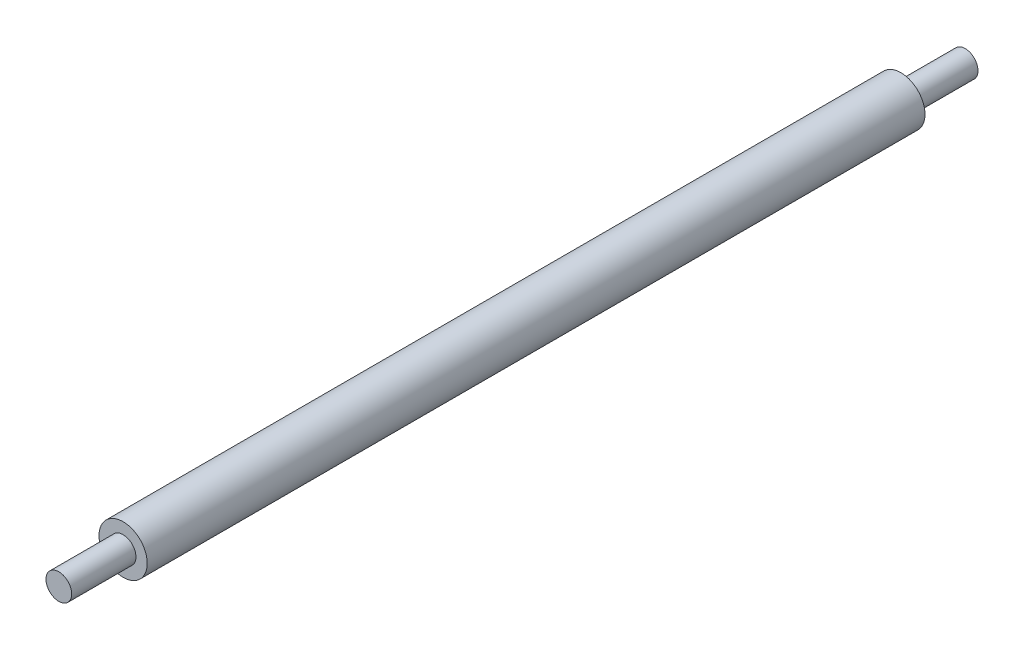
ISO-10303-21;
HEADER;
FILE_DESCRIPTION(('STEP AP214'),'2;1');
FILE_NAME('part.step','',(''),(''),'','','');
FILE_SCHEMA(('AUTOMOTIVE_DESIGN { 1 0 10303 214 1 1 1 1 }'));
ENDSEC;
DATA;
#1=APPLICATION_CONTEXT('core data for automotive mechanical design processes');
#2=APPLICATION_PROTOCOL_DEFINITION('international standard','automotive_design',2000,#1);
#3=PRODUCT_CONTEXT('',#1,'mechanical');
#4=PRODUCT('Part','Part','',(#3));
#5=PRODUCT_RELATED_PRODUCT_CATEGORY('part','',(#4));
#6=PRODUCT_DEFINITION_FORMATION('','',#4);
#7=PRODUCT_DEFINITION_CONTEXT('part definition',#1,'design');
#8=PRODUCT_DEFINITION('design','',#6,#7);
#9=PRODUCT_DEFINITION_SHAPE('','',#8);
#10=(LENGTH_UNIT() NAMED_UNIT(*) SI_UNIT(.MILLI.,.METRE.));
#11=(NAMED_UNIT(*) PLANE_ANGLE_UNIT() SI_UNIT($,.RADIAN.));
#12=(NAMED_UNIT(*) SI_UNIT($,.STERADIAN.) SOLID_ANGLE_UNIT());
#13=UNCERTAINTY_MEASURE_WITH_UNIT(LENGTH_MEASURE(1.E-05),#10,'distance_accuracy_value','');
#14=(GEOMETRIC_REPRESENTATION_CONTEXT(3) GLOBAL_UNCERTAINTY_ASSIGNED_CONTEXT((#13)) GLOBAL_UNIT_ASSIGNED_CONTEXT((#10,
#11,#12)) REPRESENTATION_CONTEXT('',''));
#15=CARTESIAN_POINT('',(0.,0.,0.));
#16=DIRECTION('',(0.,0.,1.));
#17=DIRECTION('',(1.,0.,0.));
#18=AXIS2_PLACEMENT_3D('',#15,#16,#17);
#19=CARTESIAN_POINT('',(0.,0.,242.));
#20=DIRECTION('',(0.,0.,-1.));
#21=DIRECTION('',(-1.,0.,0.));
#22=AXIS2_PLACEMENT_3D('',#19,#20,#21);
#23=CYLINDRICAL_SURFACE('',#22,7.5);
#24=CARTESIAN_POINT('',(0.,0.,242.));
#25=DIRECTION('',(0.,0.,1.));
#26=DIRECTION('',(1.,0.,0.));
#27=AXIS2_PLACEMENT_3D('',#24,#25,#26);
#28=CIRCLE('',#27,7.5);
#29=CARTESIAN_POINT('',(7.5,0.,242.));
#30=VERTEX_POINT('',#29);
#31=EDGE_CURVE('E38',#30,#30,#28,.T.);
#32=ORIENTED_EDGE('',*,*,#31,.F.);
#33=EDGE_LOOP('',(#32));
#34=FACE_BOUND('',#33,.T.);
#35=CARTESIAN_POINT('',(0.,0.,0.));
#36=DIRECTION('',(0.,0.,1.));
#37=DIRECTION('',(1.,0.,0.));
#38=AXIS2_PLACEMENT_3D('',#35,#36,#37);
#39=CIRCLE('',#38,7.5);
#40=CARTESIAN_POINT('',(7.5,0.,0.));
#41=VERTEX_POINT('',#40);
#42=EDGE_CURVE('E34',#41,#41,#39,.T.);
#43=ORIENTED_EDGE('',*,*,#42,.T.);
#44=EDGE_LOOP('',(#43));
#45=FACE_BOUND('',#44,.T.);
#46=ADVANCED_FACE('F31',(#34,#45),#23,.T.);
#47=CARTESIAN_POINT('',(0.,0.,242.));
#48=DIRECTION('',(0.,0.,1.));
#49=DIRECTION('',(1.,0.,0.));
#50=AXIS2_PLACEMENT_3D('',#47,#48,#49);
#51=PLANE('',#50);
#52=CARTESIAN_POINT('',(0.,0.,242.));
#53=DIRECTION('',(0.,0.,1.));
#54=DIRECTION('',(1.,0.,0.));
#55=AXIS2_PLACEMENT_3D('',#52,#53,#54);
#56=CIRCLE('',#55,4.);
#57=CARTESIAN_POINT('',(4.,0.,242.));
#58=VERTEX_POINT('',#57);
#59=EDGE_CURVE('E10',#58,#58,#56,.T.);
#60=ORIENTED_EDGE('',*,*,#59,.F.);
#61=EDGE_LOOP('',(#60));
#62=FACE_BOUND('',#61,.T.);
#63=ORIENTED_EDGE('',*,*,#31,.T.);
#64=EDGE_LOOP('',(#63));
#65=FACE_BOUND('',#64,.T.);
#66=ADVANCED_FACE('F66',(#62,#65),#51,.T.);
#67=CARTESIAN_POINT('',(0.,0.,0.));
#68=DIRECTION('',(0.,0.,1.));
#69=DIRECTION('',(1.,0.,0.));
#70=AXIS2_PLACEMENT_3D('',#67,#68,#69);
#71=PLANE('',#70);
#72=CARTESIAN_POINT('',(0.,0.,0.));
#73=DIRECTION('',(0.,0.,1.));
#74=DIRECTION('',(1.,0.,0.));
#75=AXIS2_PLACEMENT_3D('',#72,#73,#74);
#76=CIRCLE('',#75,4.);
#77=CARTESIAN_POINT('',(4.,0.,0.));
#78=VERTEX_POINT('',#77);
#79=EDGE_CURVE('E48',#78,#78,#76,.T.);
#80=ORIENTED_EDGE('',*,*,#79,.T.);
#81=EDGE_LOOP('',(#80));
#82=FACE_BOUND('',#81,.T.);
#83=ORIENTED_EDGE('',*,*,#42,.F.);
#84=EDGE_LOOP('',(#83));
#85=FACE_BOUND('',#84,.T.);
#86=ADVANCED_FACE('F71',(#82,#85),#71,.F.);
#87=CARTESIAN_POINT('',(0.,0.,262.));
#88=DIRECTION('',(0.,0.,-1.));
#89=DIRECTION('',(-1.,0.,0.));
#90=AXIS2_PLACEMENT_3D('',#87,#88,#89);
#91=CYLINDRICAL_SURFACE('',#90,4.);
#92=CARTESIAN_POINT('',(0.,0.,262.));
#93=DIRECTION('',(0.,0.,1.));
#94=DIRECTION('',(1.,0.,0.));
#95=AXIS2_PLACEMENT_3D('',#92,#93,#94);
#96=CIRCLE('',#95,4.);
#97=CARTESIAN_POINT('',(4.,0.,262.));
#98=VERTEX_POINT('',#97);
#99=EDGE_CURVE('E44',#98,#98,#96,.T.);
#100=ORIENTED_EDGE('',*,*,#99,.F.);
#101=EDGE_LOOP('',(#100));
#102=FACE_BOUND('',#101,.T.);
#103=ORIENTED_EDGE('',*,*,#59,.T.);
#104=EDGE_LOOP('',(#103));
#105=FACE_BOUND('',#104,.T.);
#106=ADVANCED_FACE('F80',(#102,#105),#91,.T.);
#107=CARTESIAN_POINT('',(0.,0.,262.));
#108=DIRECTION('',(0.,0.,1.));
#109=DIRECTION('',(1.,0.,0.));
#110=AXIS2_PLACEMENT_3D('',#107,#108,#109);
#111=PLANE('',#110);
#112=ORIENTED_EDGE('',*,*,#99,.T.);
#113=EDGE_LOOP('',(#112));
#114=FACE_BOUND('',#113,.T.);
#115=ADVANCED_FACE('F63',(#114),#111,.T.);
#116=CARTESIAN_POINT('',(0.,0.,-20.));
#117=DIRECTION('',(0.,0.,1.));
#118=DIRECTION('',(1.,0.,0.));
#119=AXIS2_PLACEMENT_3D('',#116,#117,#118);
#120=CYLINDRICAL_SURFACE('',#119,4.);
#121=CARTESIAN_POINT('',(0.,0.,-20.));
#122=DIRECTION('',(0.,0.,1.));
#123=DIRECTION('',(1.,0.,0.));
#124=AXIS2_PLACEMENT_3D('',#121,#122,#123);
#125=CIRCLE('',#124,4.);
#126=CARTESIAN_POINT('',(4.,0.,-20.));
#127=VERTEX_POINT('',#126);
#128=EDGE_CURVE('E47',#127,#127,#125,.T.);
#129=ORIENTED_EDGE('',*,*,#128,.T.);
#130=EDGE_LOOP('',(#129));
#131=FACE_BOUND('',#130,.T.);
#132=ORIENTED_EDGE('',*,*,#79,.F.);
#133=EDGE_LOOP('',(#132));
#134=FACE_BOUND('',#133,.T.);
#135=ADVANCED_FACE('F54',(#131,#134),#120,.T.);
#136=CARTESIAN_POINT('',(0.,0.,-20.));
#137=DIRECTION('',(0.,0.,-1.));
#138=DIRECTION('',(1.,0.,0.));
#139=AXIS2_PLACEMENT_3D('',#136,#137,#138);
#140=PLANE('',#139);
#141=ORIENTED_EDGE('',*,*,#128,.F.);
#142=EDGE_LOOP('',(#141));
#143=FACE_BOUND('',#142,.T.);
#144=ADVANCED_FACE('F57',(#143),#140,.T.);
#145=CLOSED_SHELL('',(#46,#66,#86,#106,#115,#135,#144));
#146=MANIFOLD_SOLID_BREP('B2',#145);
#147=ADVANCED_BREP_SHAPE_REPRESENTATION('',(#18,#146),#14);
#148=SHAPE_DEFINITION_REPRESENTATION(#9,#147);
ENDSEC;
END-ISO-10303-21;
